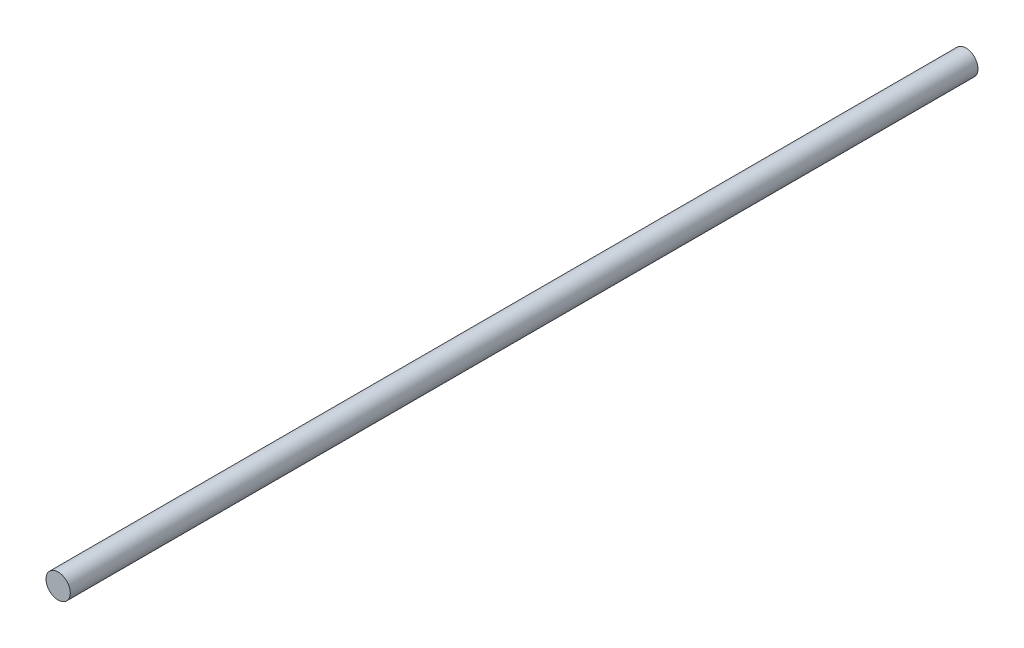
ISO-10303-21;
HEADER;
FILE_DESCRIPTION(('STEP AP214'),'2;1');
FILE_NAME('part.step','',(''),(''),'','','');
FILE_SCHEMA(('AUTOMOTIVE_DESIGN { 1 0 10303 214 1 1 1 1 }'));
ENDSEC;
DATA;
#1=APPLICATION_CONTEXT('core data for automotive mechanical design processes');
#2=APPLICATION_PROTOCOL_DEFINITION('international standard','automotive_design',2000,#1);
#3=PRODUCT_CONTEXT('',#1,'mechanical');
#4=PRODUCT('Part','Part','',(#3));
#5=PRODUCT_RELATED_PRODUCT_CATEGORY('part','',(#4));
#6=PRODUCT_DEFINITION_FORMATION('','',#4);
#7=PRODUCT_DEFINITION_CONTEXT('part definition',#1,'design');
#8=PRODUCT_DEFINITION('design','',#6,#7);
#9=PRODUCT_DEFINITION_SHAPE('','',#8);
#10=(LENGTH_UNIT() NAMED_UNIT(*) SI_UNIT(.MILLI.,.METRE.));
#11=(NAMED_UNIT(*) PLANE_ANGLE_UNIT() SI_UNIT($,.RADIAN.));
#12=(NAMED_UNIT(*) SI_UNIT($,.STERADIAN.) SOLID_ANGLE_UNIT());
#13=UNCERTAINTY_MEASURE_WITH_UNIT(LENGTH_MEASURE(1.E-05),#10,'distance_accuracy_value','');
#14=(GEOMETRIC_REPRESENTATION_CONTEXT(3) GLOBAL_UNCERTAINTY_ASSIGNED_CONTEXT((#13)) GLOBAL_UNIT_ASSIGNED_CONTEXT((#10,
#11,#12)) REPRESENTATION_CONTEXT('',''));
#15=CARTESIAN_POINT('',(0.,0.,0.));
#16=DIRECTION('',(0.,0.,1.));
#17=DIRECTION('',(1.,0.,0.));
#18=AXIS2_PLACEMENT_3D('',#15,#16,#17);
#19=CARTESIAN_POINT('',(0.,0.,112.));
#20=DIRECTION('',(0.,0.,-1.));
#21=DIRECTION('',(-1.,0.,0.));
#22=AXIS2_PLACEMENT_3D('',#19,#20,#21);
#23=CYLINDRICAL_SURFACE('',#22,1.5);
#24=CARTESIAN_POINT('',(0.,0.,112.));
#25=DIRECTION('',(0.,0.,1.));
#26=DIRECTION('',(1.,0.,0.));
#27=AXIS2_PLACEMENT_3D('',#24,#25,#26);
#28=CIRCLE('',#27,1.5);
#29=CARTESIAN_POINT('',(1.5,0.,112.));
#30=VERTEX_POINT('',#29);
#31=EDGE_CURVE('E10',#30,#30,#28,.T.);
#32=ORIENTED_EDGE('',*,*,#31,.F.);
#33=EDGE_LOOP('',(#32));
#34=FACE_BOUND('',#33,.T.);
#35=CARTESIAN_POINT('',(0.,0.,0.));
#36=DIRECTION('',(0.,0.,1.));
#37=DIRECTION('',(1.,0.,0.));
#38=AXIS2_PLACEMENT_3D('',#35,#36,#37);
#39=CIRCLE('',#38,1.5);
#40=CARTESIAN_POINT('',(1.5,0.,0.));
#41=VERTEX_POINT('',#40);
#42=EDGE_CURVE('E34',#41,#41,#39,.T.);
#43=ORIENTED_EDGE('',*,*,#42,.T.);
#44=EDGE_LOOP('',(#43));
#45=FACE_BOUND('',#44,.T.);
#46=ADVANCED_FACE('F31',(#34,#45),#23,.T.);
#47=CARTESIAN_POINT('',(0.,0.,112.));
#48=DIRECTION('',(0.,0.,1.));
#49=DIRECTION('',(1.,0.,0.));
#50=AXIS2_PLACEMENT_3D('',#47,#48,#49);
#51=PLANE('',#50);
#52=ORIENTED_EDGE('',*,*,#31,.T.);
#53=EDGE_LOOP('',(#52));
#54=FACE_BOUND('',#53,.T.);
#55=ADVANCED_FACE('F46',(#54),#51,.T.);
#56=CARTESIAN_POINT('',(0.,0.,0.));
#57=DIRECTION('',(0.,0.,1.));
#58=DIRECTION('',(1.,0.,0.));
#59=AXIS2_PLACEMENT_3D('',#56,#57,#58);
#60=PLANE('',#59);
#61=ORIENTED_EDGE('',*,*,#42,.F.);
#62=EDGE_LOOP('',(#61));
#63=FACE_BOUND('',#62,.T.);
#64=ADVANCED_FACE('F44',(#63),#60,.F.);
#65=CLOSED_SHELL('',(#46,#55,#64));
#66=MANIFOLD_SOLID_BREP('B2',#65);
#67=ADVANCED_BREP_SHAPE_REPRESENTATION('',(#18,#66),#14);
#68=SHAPE_DEFINITION_REPRESENTATION(#9,#67);
ENDSEC;
END-ISO-10303-21;
